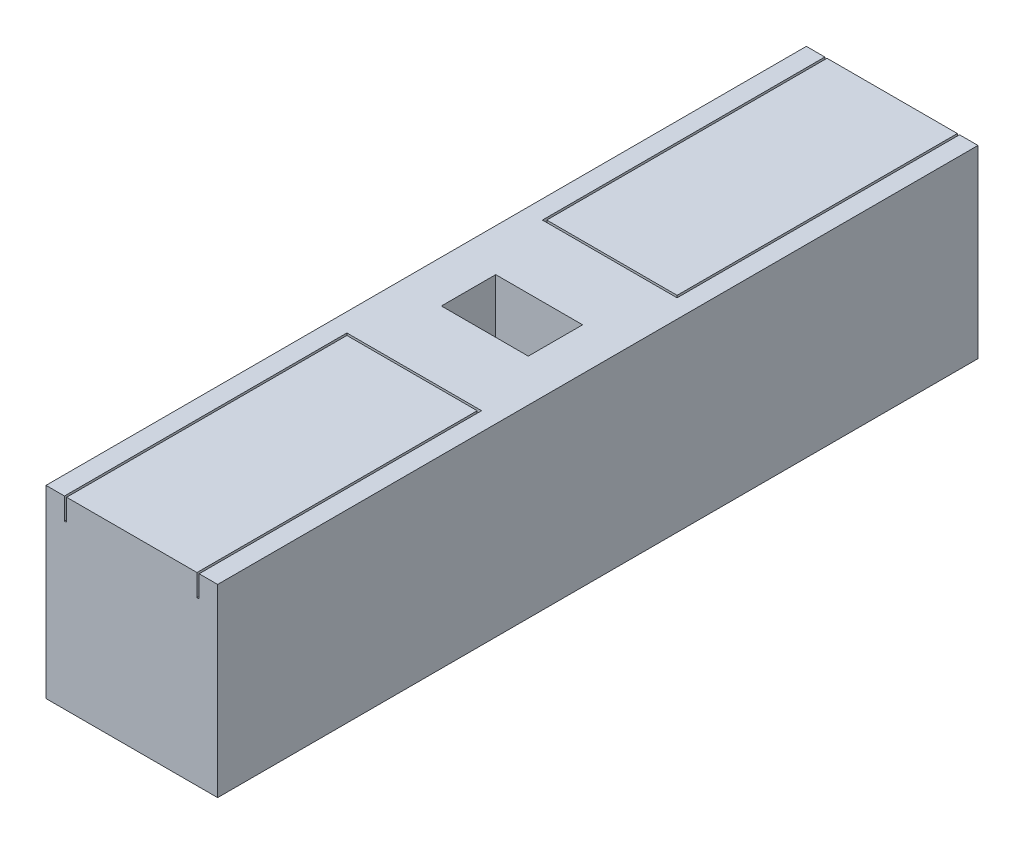
ISO-10303-21;
HEADER;
FILE_DESCRIPTION(('STEP AP214'),'2;1');
FILE_NAME('part.step','',(''),(''),'','','');
FILE_SCHEMA(('AUTOMOTIVE_DESIGN { 1 0 10303 214 1 1 1 1 }'));
ENDSEC;
DATA;
#1=APPLICATION_CONTEXT('core data for automotive mechanical design processes');
#2=APPLICATION_PROTOCOL_DEFINITION('international standard','automotive_design',2000,#1);
#3=PRODUCT_CONTEXT('',#1,'mechanical');
#4=PRODUCT('Part','Part','',(#3));
#5=PRODUCT_RELATED_PRODUCT_CATEGORY('part','',(#4));
#6=PRODUCT_DEFINITION_FORMATION('','',#4);
#7=PRODUCT_DEFINITION_CONTEXT('part definition',#1,'design');
#8=PRODUCT_DEFINITION('design','',#6,#7);
#9=PRODUCT_DEFINITION_SHAPE('','',#8);
#10=(LENGTH_UNIT() NAMED_UNIT(*) SI_UNIT(.MILLI.,.METRE.));
#11=(NAMED_UNIT(*) PLANE_ANGLE_UNIT() SI_UNIT($,.RADIAN.));
#12=(NAMED_UNIT(*) SI_UNIT($,.STERADIAN.) SOLID_ANGLE_UNIT());
#13=UNCERTAINTY_MEASURE_WITH_UNIT(LENGTH_MEASURE(1.E-05),#10,'distance_accuracy_value','');
#14=(GEOMETRIC_REPRESENTATION_CONTEXT(3) GLOBAL_UNCERTAINTY_ASSIGNED_CONTEXT((#13)) GLOBAL_UNIT_ASSIGNED_CONTEXT((#10,
#11,#12)) REPRESENTATION_CONTEXT('',''));
#15=CARTESIAN_POINT('',(0.,0.,0.));
#16=DIRECTION('',(0.,0.,1.));
#17=DIRECTION('',(1.,0.,0.));
#18=AXIS2_PLACEMENT_3D('',#15,#16,#17);
#19=CARTESIAN_POINT('',(0.,8.5,35.));
#20=DIRECTION('',(0.,-1.,0.));
#21=DIRECTION('',(0.,0.,-1.));
#22=AXIS2_PLACEMENT_3D('',#19,#20,#21);
#23=PLANE('',#22);
#24=DIRECTION('',(1.,0.,0.));
#25=VECTOR('',#24,1.);
#26=CARTESIAN_POINT('',(1.95,8.5,18.75));
#27=LINE('',#26,#25);
#28=CARTESIAN_POINT('',(1.95,8.5,18.75));
#29=VERTEX_POINT('',#28);
#30=CARTESIAN_POINT('',(5.95,8.5,18.75));
#31=VERTEX_POINT('',#30);
#32=EDGE_CURVE('E239',#29,#31,#27,.T.);
#33=ORIENTED_EDGE('',*,*,#32,.F.);
#34=DIRECTION('',(0.,0.,1.));
#35=VECTOR('',#34,1.);
#36=CARTESIAN_POINT('',(1.95,8.5,16.25));
#37=LINE('',#36,#35);
#38=CARTESIAN_POINT('',(1.95,8.5,16.25));
#39=VERTEX_POINT('',#38);
#40=EDGE_CURVE('E62',#39,#29,#37,.T.);
#41=ORIENTED_EDGE('',*,*,#40,.F.);
#42=DIRECTION('',(-1.,0.,0.));
#43=VECTOR('',#42,1.);
#44=CARTESIAN_POINT('',(1.95,8.5,16.25));
#45=LINE('',#44,#43);
#46=CARTESIAN_POINT('',(5.95,8.5,16.25));
#47=VERTEX_POINT('',#46);
#48=EDGE_CURVE('E230',#47,#39,#45,.T.);
#49=ORIENTED_EDGE('',*,*,#48,.F.);
#50=DIRECTION('',(0.,0.,-1.));
#51=VECTOR('',#50,1.);
#52=CARTESIAN_POINT('',(5.95,8.5,16.25));
#53=LINE('',#52,#51);
#54=EDGE_CURVE('E233',#31,#47,#53,.T.);
#55=ORIENTED_EDGE('',*,*,#54,.F.);
#56=EDGE_LOOP('',(#33,#41,#49,#55));
#57=FACE_BOUND('',#56,.T.);
#58=DIRECTION('',(-1.,0.,0.));
#59=VECTOR('',#58,1.);
#60=CARTESIAN_POINT('',(0.,8.5,35.));
#61=LINE('',#60,#59);
#62=CARTESIAN_POINT('',(0.850000000000001,8.5,35.));
#63=VERTEX_POINT('',#62);
#64=CARTESIAN_POINT('',(0.,8.5,35.));
#65=VERTEX_POINT('',#64);
#66=EDGE_CURVE('E368',#63,#65,#61,.T.);
#67=ORIENTED_EDGE('',*,*,#66,.F.);
#68=DIRECTION('',(0.,0.,1.));
#69=VECTOR('',#68,1.);
#70=CARTESIAN_POINT('',(0.850000000000001,8.5,35.));
#71=LINE('',#70,#69);
#72=CARTESIAN_POINT('',(0.850000000000001,8.5,22.));
#73=VERTEX_POINT('',#72);
#74=EDGE_CURVE('E271',#73,#63,#71,.T.);
#75=ORIENTED_EDGE('',*,*,#74,.F.);
#76=DIRECTION('',(-1.,0.,0.));
#77=VECTOR('',#76,1.);
#78=CARTESIAN_POINT('',(0.850000000000001,8.5,22.));
#79=LINE('',#78,#77);
#80=CARTESIAN_POINT('',(7.05,8.5,22.));
#81=VERTEX_POINT('',#80);
#82=EDGE_CURVE('E251',#81,#73,#79,.T.);
#83=ORIENTED_EDGE('',*,*,#82,.F.);
#84=DIRECTION('',(0.,0.,-1.));
#85=VECTOR('',#84,1.);
#86=CARTESIAN_POINT('',(7.05,8.5,35.));
#87=LINE('',#86,#85);
#88=CARTESIAN_POINT('',(7.05,8.5,35.));
#89=VERTEX_POINT('',#88);
#90=EDGE_CURVE('E282',#89,#81,#87,.T.);
#91=ORIENTED_EDGE('',*,*,#90,.F.);
#92=CARTESIAN_POINT('',(7.9,8.5,35.));
#93=VERTEX_POINT('',#92);
#94=EDGE_CURVE('E369',#93,#89,#61,.T.);
#95=ORIENTED_EDGE('',*,*,#94,.F.);
#96=DIRECTION('',(0.,0.,-1.));
#97=VECTOR('',#96,1.);
#98=CARTESIAN_POINT('',(7.9,8.5,35.));
#99=LINE('',#98,#97);
#100=CARTESIAN_POINT('',(7.9,8.5,0.));
#101=VERTEX_POINT('',#100);
#102=EDGE_CURVE('E386',#93,#101,#99,.T.);
#103=ORIENTED_EDGE('',*,*,#102,.T.);
#104=DIRECTION('',(-1.,0.,0.));
#105=VECTOR('',#104,1.);
#106=CARTESIAN_POINT('',(0.,8.5,0.));
#107=LINE('',#106,#105);
#108=CARTESIAN_POINT('',(7.05,8.5,0.));
#109=VERTEX_POINT('',#108);
#110=EDGE_CURVE('E364',#101,#109,#107,.T.);
#111=ORIENTED_EDGE('',*,*,#110,.T.);
#112=DIRECTION('',(0.,0.,-1.));
#113=VECTOR('',#112,1.);
#114=CARTESIAN_POINT('',(7.05,8.5,0.));
#115=LINE('',#114,#113);
#116=CARTESIAN_POINT('',(7.05,8.5,13.));
#117=VERTEX_POINT('',#116);
#118=EDGE_CURVE('E323',#117,#109,#115,.T.);
#119=ORIENTED_EDGE('',*,*,#118,.F.);
#120=DIRECTION('',(1.,0.,0.));
#121=VECTOR('',#120,1.);
#122=CARTESIAN_POINT('',(0.850000000000001,8.5,13.));
#123=LINE('',#122,#121);
#124=CARTESIAN_POINT('',(0.850000000000001,8.5,13.));
#125=VERTEX_POINT('',#124);
#126=EDGE_CURVE('E325',#125,#117,#123,.T.);
#127=ORIENTED_EDGE('',*,*,#126,.F.);
#128=DIRECTION('',(0.,0.,1.));
#129=VECTOR('',#128,1.);
#130=CARTESIAN_POINT('',(0.850000000000001,8.5,0.));
#131=LINE('',#130,#129);
#132=CARTESIAN_POINT('',(0.850000000000001,8.5,0.));
#133=VERTEX_POINT('',#132);
#134=EDGE_CURVE('E329',#133,#125,#131,.T.);
#135=ORIENTED_EDGE('',*,*,#134,.F.);
#136=CARTESIAN_POINT('',(0.,8.5,0.));
#137=VERTEX_POINT('',#136);
#138=EDGE_CURVE('E380',#133,#137,#107,.T.);
#139=ORIENTED_EDGE('',*,*,#138,.T.);
#140=DIRECTION('',(0.,0.,-1.));
#141=VECTOR('',#140,1.);
#142=CARTESIAN_POINT('',(0.,8.5,35.));
#143=LINE('',#142,#141);
#144=EDGE_CURVE('E372',#65,#137,#143,.T.);
#145=ORIENTED_EDGE('',*,*,#144,.F.);
#146=EDGE_LOOP('',(#67,#75,#83,#91,#95,#103,#111,#119,#127,#135,#139,#145));
#147=FACE_BOUND('',#146,.T.);
#148=ADVANCED_FACE('F47',(#57,#147),#23,.F.);
#149=CARTESIAN_POINT('',(6.95,8.5,35.));
#150=VERTEX_POINT('',#149);
#151=CARTESIAN_POINT('',(0.950000000000001,8.5,35.));
#152=VERTEX_POINT('',#151);
#153=EDGE_CURVE('E373',#150,#152,#61,.T.);
#154=ORIENTED_EDGE('',*,*,#153,.F.);
#155=DIRECTION('',(0.,0.,1.));
#156=VECTOR('',#155,1.);
#157=CARTESIAN_POINT('',(6.95,8.5,35.));
#158=LINE('',#157,#156);
#159=CARTESIAN_POINT('',(6.95,8.5,22.1));
#160=VERTEX_POINT('',#159);
#161=EDGE_CURVE('E280',#160,#150,#158,.T.);
#162=ORIENTED_EDGE('',*,*,#161,.F.);
#163=DIRECTION('',(1.,0.,0.));
#164=VECTOR('',#163,1.);
#165=CARTESIAN_POINT('',(0.950000000000001,8.5,22.1));
#166=LINE('',#165,#164);
#167=CARTESIAN_POINT('',(0.950000000000001,8.5,22.1));
#168=VERTEX_POINT('',#167);
#169=EDGE_CURVE('E277',#168,#160,#166,.T.);
#170=ORIENTED_EDGE('',*,*,#169,.F.);
#171=DIRECTION('',(0.,0.,-1.));
#172=VECTOR('',#171,1.);
#173=CARTESIAN_POINT('',(0.950000000000001,8.5,35.));
#174=LINE('',#173,#172);
#175=EDGE_CURVE('E273',#152,#168,#174,.T.);
#176=ORIENTED_EDGE('',*,*,#175,.F.);
#177=EDGE_LOOP('',(#154,#162,#170,#176));
#178=FACE_BOUND('',#177,.T.);
#179=ADVANCED_FACE('F458',(#178),#23,.F.);
#180=CARTESIAN_POINT('',(0.,0.,35.));
#181=DIRECTION('',(1.,0.,0.));
#182=DIRECTION('',(0.,0.,-1.));
#183=AXIS2_PLACEMENT_3D('',#180,#181,#182);
#184=PLANE('',#183);
#185=DIRECTION('',(0.,-1.,0.));
#186=VECTOR('',#185,1.);
#187=CARTESIAN_POINT('',(0.,0.,0.));
#188=LINE('',#187,#186);
#189=CARTESIAN_POINT('',(0.,0.,0.));
#190=VERTEX_POINT('',#189);
#191=EDGE_CURVE('E289',#137,#190,#188,.T.);
#192=ORIENTED_EDGE('',*,*,#191,.T.);
#193=DIRECTION('',(0.,0.,-1.));
#194=VECTOR('',#193,1.);
#195=CARTESIAN_POINT('',(0.,0.,35.));
#196=LINE('',#195,#194);
#197=CARTESIAN_POINT('',(0.,0.,35.));
#198=VERTEX_POINT('',#197);
#199=EDGE_CURVE('E11',#198,#190,#196,.T.);
#200=ORIENTED_EDGE('',*,*,#199,.F.);
#201=DIRECTION('',(0.,-1.,0.));
#202=VECTOR('',#201,1.);
#203=CARTESIAN_POINT('',(0.,0.,35.));
#204=LINE('',#203,#202);
#205=EDGE_CURVE('E360',#65,#198,#204,.T.);
#206=ORIENTED_EDGE('',*,*,#205,.F.);
#207=ORIENTED_EDGE('',*,*,#144,.T.);
#208=EDGE_LOOP('',(#192,#200,#206,#207));
#209=FACE_BOUND('',#208,.T.);
#210=ADVANCED_FACE('F49',(#209),#184,.F.);
#211=CARTESIAN_POINT('',(0.,0.,35.));
#212=DIRECTION('',(0.,1.,0.));
#213=DIRECTION('',(0.,0.,1.));
#214=AXIS2_PLACEMENT_3D('',#211,#212,#213);
#215=PLANE('',#214);
#216=DIRECTION('',(1.,0.,0.));
#217=VECTOR('',#216,1.);
#218=CARTESIAN_POINT('',(0.,0.,0.));
#219=LINE('',#218,#217);
#220=CARTESIAN_POINT('',(7.9,0.,0.));
#221=VERTEX_POINT('',#220);
#222=EDGE_CURVE('E376',#190,#221,#219,.T.);
#223=ORIENTED_EDGE('',*,*,#222,.T.);
#224=DIRECTION('',(0.,0.,-1.));
#225=VECTOR('',#224,1.);
#226=CARTESIAN_POINT('',(7.9,0.,35.));
#227=LINE('',#226,#225);
#228=CARTESIAN_POINT('',(7.9,0.,35.));
#229=VERTEX_POINT('',#228);
#230=EDGE_CURVE('E55',#229,#221,#227,.T.);
#231=ORIENTED_EDGE('',*,*,#230,.F.);
#232=DIRECTION('',(1.,0.,0.));
#233=VECTOR('',#232,1.);
#234=CARTESIAN_POINT('',(0.,0.,35.));
#235=LINE('',#234,#233);
#236=EDGE_CURVE('E363',#198,#229,#235,.T.);
#237=ORIENTED_EDGE('',*,*,#236,.F.);
#238=ORIENTED_EDGE('',*,*,#199,.T.);
#239=EDGE_LOOP('',(#223,#231,#237,#238));
#240=FACE_BOUND('',#239,.T.);
#241=ADVANCED_FACE('F416',(#240),#215,.F.);
#242=CARTESIAN_POINT('',(7.9,0.,35.));
#243=DIRECTION('',(-1.,0.,0.));
#244=DIRECTION('',(0.,0.,1.));
#245=AXIS2_PLACEMENT_3D('',#242,#243,#244);
#246=PLANE('',#245);
#247=DIRECTION('',(0.,1.,0.));
#248=VECTOR('',#247,1.);
#249=CARTESIAN_POINT('',(7.9,0.,0.));
#250=LINE('',#249,#248);
#251=EDGE_CURVE('E378',#221,#101,#250,.T.);
#252=ORIENTED_EDGE('',*,*,#251,.T.);
#253=ORIENTED_EDGE('',*,*,#102,.F.);
#254=DIRECTION('',(0.,1.,0.));
#255=VECTOR('',#254,1.);
#256=CARTESIAN_POINT('',(7.9,0.,35.));
#257=LINE('',#256,#255);
#258=EDGE_CURVE('E366',#229,#93,#257,.T.);
#259=ORIENTED_EDGE('',*,*,#258,.F.);
#260=ORIENTED_EDGE('',*,*,#230,.T.);
#261=EDGE_LOOP('',(#252,#253,#259,#260));
#262=FACE_BOUND('',#261,.T.);
#263=ADVANCED_FACE('F393',(#262),#246,.F.);
#264=DIRECTION('',(-1.,0.,0.));
#265=VECTOR('',#264,1.);
#266=CARTESIAN_POINT('',(0.950000000000001,8.5,12.9));
#267=LINE('',#266,#265);
#268=CARTESIAN_POINT('',(6.95,8.5,12.9));
#269=VERTEX_POINT('',#268);
#270=CARTESIAN_POINT('',(0.950000000000001,8.5,12.9));
#271=VERTEX_POINT('',#270);
#272=EDGE_CURVE('E334',#269,#271,#267,.T.);
#273=ORIENTED_EDGE('',*,*,#272,.F.);
#274=DIRECTION('',(0.,0.,1.));
#275=VECTOR('',#274,1.);
#276=CARTESIAN_POINT('',(6.95,8.5,0.));
#277=LINE('',#276,#275);
#278=CARTESIAN_POINT('',(6.95,8.5,0.));
#279=VERTEX_POINT('',#278);
#280=EDGE_CURVE('E274',#279,#269,#277,.T.);
#281=ORIENTED_EDGE('',*,*,#280,.F.);
#282=CARTESIAN_POINT('',(0.950000000000001,8.5,0.));
#283=VERTEX_POINT('',#282);
#284=EDGE_CURVE('E383',#279,#283,#107,.T.);
#285=ORIENTED_EDGE('',*,*,#284,.T.);
#286=DIRECTION('',(0.,0.,-1.));
#287=VECTOR('',#286,1.);
#288=CARTESIAN_POINT('',(0.950000000000001,8.5,0.));
#289=LINE('',#288,#287);
#290=EDGE_CURVE('E332',#271,#283,#289,.T.);
#291=ORIENTED_EDGE('',*,*,#290,.F.);
#292=EDGE_LOOP('',(#273,#281,#285,#291));
#293=FACE_BOUND('',#292,.T.);
#294=ADVANCED_FACE('F428',(#293),#23,.F.);
#295=CARTESIAN_POINT('',(0.,0.,35.));
#296=DIRECTION('',(0.,0.,-1.));
#297=DIRECTION('',(-1.,0.,0.));
#298=AXIS2_PLACEMENT_3D('',#295,#296,#297);
#299=PLANE('',#298);
#300=ORIENTED_EDGE('',*,*,#94,.T.);
#301=DIRECTION('',(0.,1.,0.));
#302=VECTOR('',#301,1.);
#303=CARTESIAN_POINT('',(7.05,7.5,35.));
#304=LINE('',#303,#302);
#305=CARTESIAN_POINT('',(7.05,7.5,35.));
#306=VERTEX_POINT('',#305);
#307=EDGE_CURVE('E292',#306,#89,#304,.T.);
#308=ORIENTED_EDGE('',*,*,#307,.F.);
#309=DIRECTION('',(1.,0.,0.));
#310=VECTOR('',#309,1.);
#311=CARTESIAN_POINT('',(6.95,7.5,35.));
#312=LINE('',#311,#310);
#313=CARTESIAN_POINT('',(6.95,7.5,35.));
#314=VERTEX_POINT('',#313);
#315=EDGE_CURVE('E262',#314,#306,#312,.T.);
#316=ORIENTED_EDGE('',*,*,#315,.F.);
#317=DIRECTION('',(0.,1.,0.));
#318=VECTOR('',#317,1.);
#319=CARTESIAN_POINT('',(6.95,7.5,35.));
#320=LINE('',#319,#318);
#321=EDGE_CURVE('E294',#314,#150,#320,.T.);
#322=ORIENTED_EDGE('',*,*,#321,.T.);
#323=ORIENTED_EDGE('',*,*,#153,.T.);
#324=DIRECTION('',(0.,1.,0.));
#325=VECTOR('',#324,1.);
#326=CARTESIAN_POINT('',(0.950000000000001,7.5,35.));
#327=LINE('',#326,#325);
#328=CARTESIAN_POINT('',(0.950000000000001,7.5,35.));
#329=VERTEX_POINT('',#328);
#330=EDGE_CURVE('E301',#329,#152,#327,.T.);
#331=ORIENTED_EDGE('',*,*,#330,.F.);
#332=DIRECTION('',(1.,0.,0.));
#333=VECTOR('',#332,1.);
#334=CARTESIAN_POINT('',(0.850000000000001,7.5,35.));
#335=LINE('',#334,#333);
#336=CARTESIAN_POINT('',(0.850000000000001,7.5,35.));
#337=VERTEX_POINT('',#336);
#338=EDGE_CURVE('E250',#337,#329,#335,.T.);
#339=ORIENTED_EDGE('',*,*,#338,.F.);
#340=DIRECTION('',(0.,1.,0.));
#341=VECTOR('',#340,1.);
#342=CARTESIAN_POINT('',(0.850000000000001,7.5,35.));
#343=LINE('',#342,#341);
#344=EDGE_CURVE('E270',#337,#63,#343,.T.);
#345=ORIENTED_EDGE('',*,*,#344,.T.);
#346=ORIENTED_EDGE('',*,*,#66,.T.);
#347=ORIENTED_EDGE('',*,*,#205,.T.);
#348=ORIENTED_EDGE('',*,*,#236,.T.);
#349=ORIENTED_EDGE('',*,*,#258,.T.);
#350=EDGE_LOOP('',(#300,#308,#316,#322,#323,#331,#339,#345,#346,#347,#348,#349));
#351=FACE_BOUND('',#350,.T.);
#352=ADVANCED_FACE('F412',(#351),#299,.F.);
#353=CARTESIAN_POINT('',(0.,0.,0.));
#354=DIRECTION('',(0.,0.,-1.));
#355=DIRECTION('',(-1.,0.,0.));
#356=AXIS2_PLACEMENT_3D('',#353,#354,#355);
#357=PLANE('',#356);
#358=DIRECTION('',(0.,1.,0.));
#359=VECTOR('',#358,1.);
#360=CARTESIAN_POINT('',(0.850000000000001,7.5,0.));
#361=LINE('',#360,#359);
#362=CARTESIAN_POINT('',(0.850000000000001,7.5,0.));
#363=VERTEX_POINT('',#362);
#364=EDGE_CURVE('E313',#363,#133,#361,.T.);
#365=ORIENTED_EDGE('',*,*,#364,.F.);
#366=DIRECTION('',(-1.,0.,0.));
#367=VECTOR('',#366,1.);
#368=CARTESIAN_POINT('',(0.850000000000001,7.5,0.));
#369=LINE('',#368,#367);
#370=CARTESIAN_POINT('',(0.950000000000001,7.5,0.));
#371=VERTEX_POINT('',#370);
#372=EDGE_CURVE('E349',#371,#363,#369,.T.);
#373=ORIENTED_EDGE('',*,*,#372,.F.);
#374=DIRECTION('',(0.,1.,0.));
#375=VECTOR('',#374,1.);
#376=CARTESIAN_POINT('',(0.950000000000001,7.5,0.));
#377=LINE('',#376,#375);
#378=EDGE_CURVE('E310',#371,#283,#377,.T.);
#379=ORIENTED_EDGE('',*,*,#378,.T.);
#380=ORIENTED_EDGE('',*,*,#284,.F.);
#381=DIRECTION('',(0.,1.,0.));
#382=VECTOR('',#381,1.);
#383=CARTESIAN_POINT('',(6.95,7.5,0.));
#384=LINE('',#383,#382);
#385=CARTESIAN_POINT('',(6.95,7.5,0.));
#386=VERTEX_POINT('',#385);
#387=EDGE_CURVE('E245',#386,#279,#384,.T.);
#388=ORIENTED_EDGE('',*,*,#387,.F.);
#389=DIRECTION('',(-1.,0.,0.));
#390=VECTOR('',#389,1.);
#391=CARTESIAN_POINT('',(6.95,7.5,0.));
#392=LINE('',#391,#390);
#393=CARTESIAN_POINT('',(7.05,7.5,0.));
#394=VERTEX_POINT('',#393);
#395=EDGE_CURVE('E307',#394,#386,#392,.T.);
#396=ORIENTED_EDGE('',*,*,#395,.F.);
#397=DIRECTION('',(0.,1.,0.));
#398=VECTOR('',#397,1.);
#399=CARTESIAN_POINT('',(7.05,7.5,0.));
#400=LINE('',#399,#398);
#401=EDGE_CURVE('E319',#394,#109,#400,.T.);
#402=ORIENTED_EDGE('',*,*,#401,.T.);
#403=ORIENTED_EDGE('',*,*,#110,.F.);
#404=ORIENTED_EDGE('',*,*,#251,.F.);
#405=ORIENTED_EDGE('',*,*,#222,.F.);
#406=ORIENTED_EDGE('',*,*,#191,.F.);
#407=ORIENTED_EDGE('',*,*,#138,.F.);
#408=EDGE_LOOP('',(#365,#373,#379,#380,#388,#396,#402,#403,#404,#405,#406,#407));
#409=FACE_BOUND('',#408,.T.);
#410=ADVANCED_FACE('F399',(#409),#357,.T.);
#411=CARTESIAN_POINT('',(6.95,7.5,0.));
#412=DIRECTION('',(-1.,0.,0.));
#413=DIRECTION('',(0.,0.,1.));
#414=AXIS2_PLACEMENT_3D('',#411,#412,#413);
#415=PLANE('',#414);
#416=ORIENTED_EDGE('',*,*,#280,.T.);
#417=DIRECTION('',(0.,1.,0.));
#418=VECTOR('',#417,1.);
#419=CARTESIAN_POINT('',(6.95,7.5,12.9));
#420=LINE('',#419,#418);
#421=CARTESIAN_POINT('',(6.95,7.5,12.9));
#422=VERTEX_POINT('',#421);
#423=EDGE_CURVE('E305',#422,#269,#420,.T.);
#424=ORIENTED_EDGE('',*,*,#423,.F.);
#425=DIRECTION('',(0.,0.,1.));
#426=VECTOR('',#425,1.);
#427=CARTESIAN_POINT('',(6.95,7.5,0.));
#428=LINE('',#427,#426);
#429=EDGE_CURVE('E326',#386,#422,#428,.T.);
#430=ORIENTED_EDGE('',*,*,#429,.F.);
#431=ORIENTED_EDGE('',*,*,#387,.T.);
#432=EDGE_LOOP('',(#416,#424,#430,#431));
#433=FACE_BOUND('',#432,.T.);
#434=ADVANCED_FACE('F439',(#433),#415,.F.);
#435=CARTESIAN_POINT('',(7.05,7.5,0.));
#436=DIRECTION('',(1.,0.,0.));
#437=DIRECTION('',(0.,0.,-1.));
#438=AXIS2_PLACEMENT_3D('',#435,#436,#437);
#439=PLANE('',#438);
#440=ORIENTED_EDGE('',*,*,#118,.T.);
#441=ORIENTED_EDGE('',*,*,#401,.F.);
#442=DIRECTION('',(0.,0.,-1.));
#443=VECTOR('',#442,1.);
#444=CARTESIAN_POINT('',(7.05,7.5,0.));
#445=LINE('',#444,#443);
#446=CARTESIAN_POINT('',(7.05,7.5,13.));
#447=VERTEX_POINT('',#446);
#448=EDGE_CURVE('E341',#447,#394,#445,.T.);
#449=ORIENTED_EDGE('',*,*,#448,.F.);
#450=DIRECTION('',(0.,1.,0.));
#451=VECTOR('',#450,1.);
#452=CARTESIAN_POINT('',(7.05,7.5,13.));
#453=LINE('',#452,#451);
#454=EDGE_CURVE('E317',#447,#117,#453,.T.);
#455=ORIENTED_EDGE('',*,*,#454,.T.);
#456=EDGE_LOOP('',(#440,#441,#449,#455));
#457=FACE_BOUND('',#456,.T.);
#458=ADVANCED_FACE('F443',(#457),#439,.F.);
#459=CARTESIAN_POINT('',(0.850000000000001,7.5,13.));
#460=DIRECTION('',(0.,0.,1.));
#461=DIRECTION('',(1.,0.,0.));
#462=AXIS2_PLACEMENT_3D('',#459,#460,#461);
#463=PLANE('',#462);
#464=ORIENTED_EDGE('',*,*,#126,.T.);
#465=ORIENTED_EDGE('',*,*,#454,.F.);
#466=DIRECTION('',(1.,0.,0.));
#467=VECTOR('',#466,1.);
#468=CARTESIAN_POINT('',(0.850000000000001,7.5,13.));
#469=LINE('',#468,#467);
#470=CARTESIAN_POINT('',(0.850000000000001,7.5,13.));
#471=VERTEX_POINT('',#470);
#472=EDGE_CURVE('E343',#471,#447,#469,.T.);
#473=ORIENTED_EDGE('',*,*,#472,.F.);
#474=DIRECTION('',(0.,1.,0.));
#475=VECTOR('',#474,1.);
#476=CARTESIAN_POINT('',(0.850000000000001,7.5,13.));
#477=LINE('',#476,#475);
#478=EDGE_CURVE('E315',#471,#125,#477,.T.);
#479=ORIENTED_EDGE('',*,*,#478,.T.);
#480=EDGE_LOOP('',(#464,#465,#473,#479));
#481=FACE_BOUND('',#480,.T.);
#482=ADVANCED_FACE('F445',(#481),#463,.F.);
#483=CARTESIAN_POINT('',(0.850000000000001,7.5,0.));
#484=DIRECTION('',(-1.,0.,0.));
#485=DIRECTION('',(0.,0.,1.));
#486=AXIS2_PLACEMENT_3D('',#483,#484,#485);
#487=PLANE('',#486);
#488=ORIENTED_EDGE('',*,*,#134,.T.);
#489=ORIENTED_EDGE('',*,*,#478,.F.);
#490=DIRECTION('',(0.,0.,1.));
#491=VECTOR('',#490,1.);
#492=CARTESIAN_POINT('',(0.850000000000001,7.5,0.));
#493=LINE('',#492,#491);
#494=EDGE_CURVE('E346',#363,#471,#493,.T.);
#495=ORIENTED_EDGE('',*,*,#494,.F.);
#496=ORIENTED_EDGE('',*,*,#364,.T.);
#497=EDGE_LOOP('',(#488,#489,#495,#496));
#498=FACE_BOUND('',#497,.T.);
#499=ADVANCED_FACE('F447',(#498),#487,.F.);
#500=CARTESIAN_POINT('',(0.950000000000001,7.5,0.));
#501=DIRECTION('',(1.,0.,0.));
#502=DIRECTION('',(0.,0.,-1.));
#503=AXIS2_PLACEMENT_3D('',#500,#501,#502);
#504=PLANE('',#503);
#505=ORIENTED_EDGE('',*,*,#290,.T.);
#506=ORIENTED_EDGE('',*,*,#378,.F.);
#507=DIRECTION('',(0.,0.,-1.));
#508=VECTOR('',#507,1.);
#509=CARTESIAN_POINT('',(0.950000000000001,7.5,0.));
#510=LINE('',#509,#508);
#511=CARTESIAN_POINT('',(0.950000000000001,7.5,12.9));
#512=VERTEX_POINT('',#511);
#513=EDGE_CURVE('E352',#512,#371,#510,.T.);
#514=ORIENTED_EDGE('',*,*,#513,.F.);
#515=DIRECTION('',(0.,1.,0.));
#516=VECTOR('',#515,1.);
#517=CARTESIAN_POINT('',(0.950000000000001,7.5,12.9));
#518=LINE('',#517,#516);
#519=EDGE_CURVE('E308',#512,#271,#518,.T.);
#520=ORIENTED_EDGE('',*,*,#519,.T.);
#521=EDGE_LOOP('',(#505,#506,#514,#520));
#522=FACE_BOUND('',#521,.T.);
#523=ADVANCED_FACE('F432',(#522),#504,.F.);
#524=CARTESIAN_POINT('',(0.950000000000001,7.5,12.9));
#525=DIRECTION('',(0.,0.,-1.));
#526=DIRECTION('',(-1.,0.,0.));
#527=AXIS2_PLACEMENT_3D('',#524,#525,#526);
#528=PLANE('',#527);
#529=ORIENTED_EDGE('',*,*,#272,.T.);
#530=ORIENTED_EDGE('',*,*,#519,.F.);
#531=DIRECTION('',(-1.,0.,0.));
#532=VECTOR('',#531,1.);
#533=CARTESIAN_POINT('',(0.950000000000001,7.5,12.9));
#534=LINE('',#533,#532);
#535=EDGE_CURVE('E355',#422,#512,#534,.T.);
#536=ORIENTED_EDGE('',*,*,#535,.F.);
#537=ORIENTED_EDGE('',*,*,#423,.T.);
#538=EDGE_LOOP('',(#529,#530,#536,#537));
#539=FACE_BOUND('',#538,.T.);
#540=ADVANCED_FACE('F437',(#539),#528,.F.);
#541=CARTESIAN_POINT('',(0.,7.5,0.));
#542=DIRECTION('',(0.,1.,0.));
#543=DIRECTION('',(0.,0.,1.));
#544=AXIS2_PLACEMENT_3D('',#541,#542,#543);
#545=PLANE('',#544);
#546=ORIENTED_EDGE('',*,*,#429,.T.);
#547=ORIENTED_EDGE('',*,*,#535,.T.);
#548=ORIENTED_EDGE('',*,*,#513,.T.);
#549=ORIENTED_EDGE('',*,*,#372,.T.);
#550=ORIENTED_EDGE('',*,*,#494,.T.);
#551=ORIENTED_EDGE('',*,*,#472,.T.);
#552=ORIENTED_EDGE('',*,*,#448,.T.);
#553=ORIENTED_EDGE('',*,*,#395,.T.);
#554=EDGE_LOOP('',(#546,#547,#548,#549,#550,#551,#552,#553));
#555=FACE_BOUND('',#554,.T.);
#556=ADVANCED_FACE('F434',(#555),#545,.T.);
#557=CARTESIAN_POINT('',(0.850000000000001,7.5,35.));
#558=DIRECTION('',(-1.,0.,0.));
#559=DIRECTION('',(0.,0.,1.));
#560=AXIS2_PLACEMENT_3D('',#557,#558,#559);
#561=PLANE('',#560);
#562=ORIENTED_EDGE('',*,*,#74,.T.);
#563=ORIENTED_EDGE('',*,*,#344,.F.);
#564=DIRECTION('',(0.,0.,1.));
#565=VECTOR('',#564,1.);
#566=CARTESIAN_POINT('',(0.850000000000001,7.5,35.));
#567=LINE('',#566,#565);
#568=CARTESIAN_POINT('',(0.850000000000001,7.5,22.));
#569=VERTEX_POINT('',#568);
#570=EDGE_CURVE('E70',#569,#337,#567,.T.);
#571=ORIENTED_EDGE('',*,*,#570,.F.);
#572=DIRECTION('',(0.,1.,0.));
#573=VECTOR('',#572,1.);
#574=CARTESIAN_POINT('',(0.850000000000001,7.5,22.));
#575=LINE('',#574,#573);
#576=EDGE_CURVE('E287',#569,#73,#575,.T.);
#577=ORIENTED_EDGE('',*,*,#576,.T.);
#578=EDGE_LOOP('',(#562,#563,#571,#577));
#579=FACE_BOUND('',#578,.T.);
#580=ADVANCED_FACE('F577',(#579),#561,.F.);
#581=CARTESIAN_POINT('',(0.850000000000001,7.5,22.));
#582=DIRECTION('',(0.,0.,-1.));
#583=DIRECTION('',(-1.,0.,0.));
#584=AXIS2_PLACEMENT_3D('',#581,#582,#583);
#585=PLANE('',#584);
#586=ORIENTED_EDGE('',*,*,#82,.T.);
#587=ORIENTED_EDGE('',*,*,#576,.F.);
#588=DIRECTION('',(-1.,0.,0.));
#589=VECTOR('',#588,1.);
#590=CARTESIAN_POINT('',(0.850000000000001,7.5,22.));
#591=LINE('',#590,#589);
#592=CARTESIAN_POINT('',(7.05,7.5,22.));
#593=VERTEX_POINT('',#592);
#594=EDGE_CURVE('E268',#593,#569,#591,.T.);
#595=ORIENTED_EDGE('',*,*,#594,.F.);
#596=DIRECTION('',(0.,1.,0.));
#597=VECTOR('',#596,1.);
#598=CARTESIAN_POINT('',(7.05,7.5,22.));
#599=LINE('',#598,#597);
#600=EDGE_CURVE('E290',#593,#81,#599,.T.);
#601=ORIENTED_EDGE('',*,*,#600,.T.);
#602=EDGE_LOOP('',(#586,#587,#595,#601));
#603=FACE_BOUND('',#602,.T.);
#604=ADVANCED_FACE('F586',(#603),#585,.F.);
#605=CARTESIAN_POINT('',(7.05,7.5,35.));
#606=DIRECTION('',(1.,0.,0.));
#607=DIRECTION('',(0.,0.,-1.));
#608=AXIS2_PLACEMENT_3D('',#605,#606,#607);
#609=PLANE('',#608);
#610=ORIENTED_EDGE('',*,*,#90,.T.);
#611=ORIENTED_EDGE('',*,*,#600,.F.);
#612=DIRECTION('',(0.,0.,-1.));
#613=VECTOR('',#612,1.);
#614=CARTESIAN_POINT('',(7.05,7.5,35.));
#615=LINE('',#614,#613);
#616=EDGE_CURVE('E265',#306,#593,#615,.T.);
#617=ORIENTED_EDGE('',*,*,#616,.F.);
#618=ORIENTED_EDGE('',*,*,#307,.T.);
#619=EDGE_LOOP('',(#610,#611,#617,#618));
#620=FACE_BOUND('',#619,.T.);
#621=ADVANCED_FACE('F596',(#620),#609,.F.);
#622=CARTESIAN_POINT('',(6.95,7.5,35.));
#623=DIRECTION('',(-1.,0.,0.));
#624=DIRECTION('',(0.,0.,1.));
#625=AXIS2_PLACEMENT_3D('',#622,#623,#624);
#626=PLANE('',#625);
#627=ORIENTED_EDGE('',*,*,#161,.T.);
#628=ORIENTED_EDGE('',*,*,#321,.F.);
#629=DIRECTION('',(0.,0.,1.));
#630=VECTOR('',#629,1.);
#631=CARTESIAN_POINT('',(6.95,7.5,35.));
#632=LINE('',#631,#630);
#633=CARTESIAN_POINT('',(6.95,7.5,22.1));
#634=VERTEX_POINT('',#633);
#635=EDGE_CURVE('E259',#634,#314,#632,.T.);
#636=ORIENTED_EDGE('',*,*,#635,.F.);
#637=DIRECTION('',(0.,1.,0.));
#638=VECTOR('',#637,1.);
#639=CARTESIAN_POINT('',(6.95,7.5,22.1));
#640=LINE('',#639,#638);
#641=EDGE_CURVE('E297',#634,#160,#640,.T.);
#642=ORIENTED_EDGE('',*,*,#641,.T.);
#643=EDGE_LOOP('',(#627,#628,#636,#642));
#644=FACE_BOUND('',#643,.T.);
#645=ADVANCED_FACE('F606',(#644),#626,.F.);
#646=CARTESIAN_POINT('',(0.950000000000001,7.5,22.1));
#647=DIRECTION('',(0.,0.,1.));
#648=DIRECTION('',(1.,0.,0.));
#649=AXIS2_PLACEMENT_3D('',#646,#647,#648);
#650=PLANE('',#649);
#651=ORIENTED_EDGE('',*,*,#169,.T.);
#652=ORIENTED_EDGE('',*,*,#641,.F.);
#653=DIRECTION('',(1.,0.,0.));
#654=VECTOR('',#653,1.);
#655=CARTESIAN_POINT('',(0.950000000000001,7.5,22.1));
#656=LINE('',#655,#654);
#657=CARTESIAN_POINT('',(0.950000000000001,7.5,22.1));
#658=VERTEX_POINT('',#657);
#659=EDGE_CURVE('E256',#658,#634,#656,.T.);
#660=ORIENTED_EDGE('',*,*,#659,.F.);
#661=DIRECTION('',(0.,1.,0.));
#662=VECTOR('',#661,1.);
#663=CARTESIAN_POINT('',(0.950000000000001,7.5,22.1));
#664=LINE('',#663,#662);
#665=EDGE_CURVE('E299',#658,#168,#664,.T.);
#666=ORIENTED_EDGE('',*,*,#665,.T.);
#667=EDGE_LOOP('',(#651,#652,#660,#666));
#668=FACE_BOUND('',#667,.T.);
#669=ADVANCED_FACE('F617',(#668),#650,.F.);
#670=CARTESIAN_POINT('',(0.950000000000001,7.5,35.));
#671=DIRECTION('',(1.,0.,0.));
#672=DIRECTION('',(0.,0.,-1.));
#673=AXIS2_PLACEMENT_3D('',#670,#671,#672);
#674=PLANE('',#673);
#675=ORIENTED_EDGE('',*,*,#175,.T.);
#676=ORIENTED_EDGE('',*,*,#665,.F.);
#677=DIRECTION('',(0.,0.,-1.));
#678=VECTOR('',#677,1.);
#679=CARTESIAN_POINT('',(0.950000000000001,7.5,35.));
#680=LINE('',#679,#678);
#681=EDGE_CURVE('E253',#329,#658,#680,.T.);
#682=ORIENTED_EDGE('',*,*,#681,.F.);
#683=ORIENTED_EDGE('',*,*,#330,.T.);
#684=EDGE_LOOP('',(#675,#676,#682,#683));
#685=FACE_BOUND('',#684,.T.);
#686=ADVANCED_FACE('F629',(#685),#674,.F.);
#687=CARTESIAN_POINT('',(0.,7.5,0.));
#688=DIRECTION('',(0.,-1.,0.));
#689=DIRECTION('',(0.,0.,-1.));
#690=AXIS2_PLACEMENT_3D('',#687,#688,#689);
#691=PLANE('',#690);
#692=ORIENTED_EDGE('',*,*,#570,.T.);
#693=ORIENTED_EDGE('',*,*,#338,.T.);
#694=ORIENTED_EDGE('',*,*,#681,.T.);
#695=ORIENTED_EDGE('',*,*,#659,.T.);
#696=ORIENTED_EDGE('',*,*,#635,.T.);
#697=ORIENTED_EDGE('',*,*,#315,.T.);
#698=ORIENTED_EDGE('',*,*,#616,.T.);
#699=ORIENTED_EDGE('',*,*,#594,.T.);
#700=EDGE_LOOP('',(#692,#693,#694,#695,#696,#697,#698,#699));
#701=FACE_BOUND('',#700,.T.);
#702=ADVANCED_FACE('F641',(#701),#691,.F.);
#703=CARTESIAN_POINT('',(1.95,5.,16.25));
#704=DIRECTION('',(-1.,0.,0.));
#705=DIRECTION('',(0.,0.,1.));
#706=AXIS2_PLACEMENT_3D('',#703,#704,#705);
#707=PLANE('',#706);
#708=ORIENTED_EDGE('',*,*,#40,.T.);
#709=DIRECTION('',(0.,1.,0.));
#710=VECTOR('',#709,1.);
#711=CARTESIAN_POINT('',(1.95,5.,18.75));
#712=LINE('',#711,#710);
#713=CARTESIAN_POINT('',(1.95,5.,18.75));
#714=VERTEX_POINT('',#713);
#715=EDGE_CURVE('E208',#714,#29,#712,.T.);
#716=ORIENTED_EDGE('',*,*,#715,.F.);
#717=DIRECTION('',(0.,0.,1.));
#718=VECTOR('',#717,1.);
#719=CARTESIAN_POINT('',(1.95,5.,16.25));
#720=LINE('',#719,#718);
#721=CARTESIAN_POINT('',(1.95,5.,16.25));
#722=VERTEX_POINT('',#721);
#723=EDGE_CURVE('E212',#722,#714,#720,.T.);
#724=ORIENTED_EDGE('',*,*,#723,.F.);
#725=DIRECTION('',(0.,1.,0.));
#726=VECTOR('',#725,1.);
#727=CARTESIAN_POINT('',(1.95,5.,16.25));
#728=LINE('',#727,#726);
#729=EDGE_CURVE('E243',#722,#39,#728,.T.);
#730=ORIENTED_EDGE('',*,*,#729,.T.);
#731=EDGE_LOOP('',(#708,#716,#724,#730));
#732=FACE_BOUND('',#731,.T.);
#733=ADVANCED_FACE('F210',(#732),#707,.F.);
#734=CARTESIAN_POINT('',(1.95,5.,16.25));
#735=DIRECTION('',(0.,0.,-1.));
#736=DIRECTION('',(-1.,0.,0.));
#737=AXIS2_PLACEMENT_3D('',#734,#735,#736);
#738=PLANE('',#737);
#739=ORIENTED_EDGE('',*,*,#48,.T.);
#740=ORIENTED_EDGE('',*,*,#729,.F.);
#741=DIRECTION('',(-1.,0.,0.));
#742=VECTOR('',#741,1.);
#743=CARTESIAN_POINT('',(1.95,5.,16.25));
#744=LINE('',#743,#742);
#745=CARTESIAN_POINT('',(5.95,5.,16.25));
#746=VERTEX_POINT('',#745);
#747=EDGE_CURVE('E218',#746,#722,#744,.T.);
#748=ORIENTED_EDGE('',*,*,#747,.F.);
#749=DIRECTION('',(0.,1.,0.));
#750=VECTOR('',#749,1.);
#751=CARTESIAN_POINT('',(5.95,5.,16.25));
#752=LINE('',#751,#750);
#753=EDGE_CURVE('E246',#746,#47,#752,.T.);
#754=ORIENTED_EDGE('',*,*,#753,.T.);
#755=EDGE_LOOP('',(#739,#740,#748,#754));
#756=FACE_BOUND('',#755,.T.);
#757=ADVANCED_FACE('F658',(#756),#738,.F.);
#758=CARTESIAN_POINT('',(5.95,5.,16.25));
#759=DIRECTION('',(1.,0.,0.));
#760=DIRECTION('',(0.,0.,-1.));
#761=AXIS2_PLACEMENT_3D('',#758,#759,#760);
#762=PLANE('',#761);
#763=ORIENTED_EDGE('',*,*,#54,.T.);
#764=ORIENTED_EDGE('',*,*,#753,.F.);
#765=DIRECTION('',(0.,0.,-1.));
#766=VECTOR('',#765,1.);
#767=CARTESIAN_POINT('',(5.95,5.,16.25));
#768=LINE('',#767,#766);
#769=CARTESIAN_POINT('',(5.95,5.,18.75));
#770=VERTEX_POINT('',#769);
#771=EDGE_CURVE('E226',#770,#746,#768,.T.);
#772=ORIENTED_EDGE('',*,*,#771,.F.);
#773=DIRECTION('',(0.,1.,0.));
#774=VECTOR('',#773,1.);
#775=CARTESIAN_POINT('',(5.95,5.,18.75));
#776=LINE('',#775,#774);
#777=EDGE_CURVE('E217',#770,#31,#776,.T.);
#778=ORIENTED_EDGE('',*,*,#777,.T.);
#779=EDGE_LOOP('',(#763,#764,#772,#778));
#780=FACE_BOUND('',#779,.T.);
#781=ADVANCED_FACE('F667',(#780),#762,.F.);
#782=CARTESIAN_POINT('',(1.95,5.,18.75));
#783=DIRECTION('',(0.,0.,1.));
#784=DIRECTION('',(1.,0.,0.));
#785=AXIS2_PLACEMENT_3D('',#782,#783,#784);
#786=PLANE('',#785);
#787=ORIENTED_EDGE('',*,*,#32,.T.);
#788=ORIENTED_EDGE('',*,*,#777,.F.);
#789=DIRECTION('',(1.,0.,0.));
#790=VECTOR('',#789,1.);
#791=CARTESIAN_POINT('',(1.95,5.,18.75));
#792=LINE('',#791,#790);
#793=EDGE_CURVE('E221',#714,#770,#792,.T.);
#794=ORIENTED_EDGE('',*,*,#793,.F.);
#795=ORIENTED_EDGE('',*,*,#715,.T.);
#796=EDGE_LOOP('',(#787,#788,#794,#795));
#797=FACE_BOUND('',#796,.T.);
#798=ADVANCED_FACE('F222',(#797),#786,.F.);
#799=CARTESIAN_POINT('',(0.,5.,0.));
#800=DIRECTION('',(0.,1.,0.));
#801=DIRECTION('',(0.,0.,1.));
#802=AXIS2_PLACEMENT_3D('',#799,#800,#801);
#803=PLANE('',#802);
#804=ORIENTED_EDGE('',*,*,#723,.T.);
#805=ORIENTED_EDGE('',*,*,#793,.T.);
#806=ORIENTED_EDGE('',*,*,#771,.T.);
#807=ORIENTED_EDGE('',*,*,#747,.T.);
#808=EDGE_LOOP('',(#804,#805,#806,#807));
#809=FACE_BOUND('',#808,.T.);
#810=ADVANCED_FACE('F228',(#809),#803,.T.);
#811=CLOSED_SHELL('',(#148,#179,#210,#241,#263,#294,#352,#410,#434,#458,#482,#499,#523,#540,
#556,#580,#604,#621,#645,#669,#686,#702,#733,#757,#781,#798,#810));
#812=MANIFOLD_SOLID_BREP('B2',#811);
#813=ADVANCED_BREP_SHAPE_REPRESENTATION('',(#18,#812),#14);
#814=SHAPE_DEFINITION_REPRESENTATION(#9,#813);
ENDSEC;
END-ISO-10303-21;
